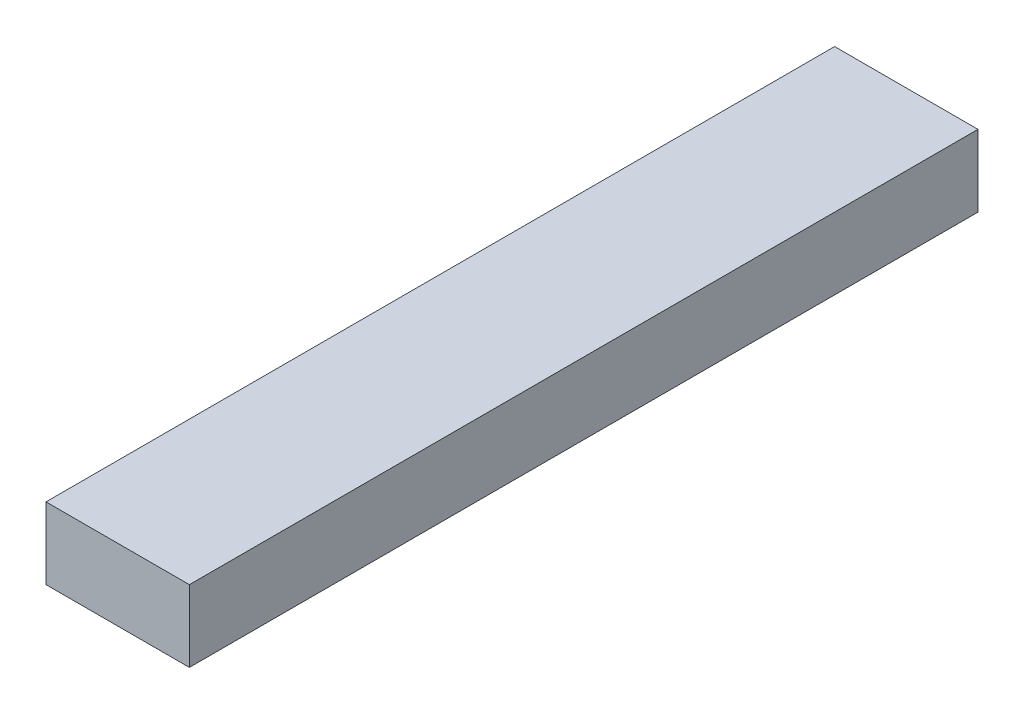
ISO-10303-21;
HEADER;
FILE_DESCRIPTION(('STEP AP214'),'2;1');
FILE_NAME('part.step','',(''),(''),'','','');
FILE_SCHEMA(('AUTOMOTIVE_DESIGN { 1 0 10303 214 1 1 1 1 }'));
ENDSEC;
DATA;
#1=APPLICATION_CONTEXT('core data for automotive mechanical design processes');
#2=APPLICATION_PROTOCOL_DEFINITION('international standard','automotive_design',2000,#1);
#3=PRODUCT_CONTEXT('',#1,'mechanical');
#4=PRODUCT('Part','Part','',(#3));
#5=PRODUCT_RELATED_PRODUCT_CATEGORY('part','',(#4));
#6=PRODUCT_DEFINITION_FORMATION('','',#4);
#7=PRODUCT_DEFINITION_CONTEXT('part definition',#1,'design');
#8=PRODUCT_DEFINITION('design','',#6,#7);
#9=PRODUCT_DEFINITION_SHAPE('','',#8);
#10=(LENGTH_UNIT() NAMED_UNIT(*) SI_UNIT(.MILLI.,.METRE.));
#11=(NAMED_UNIT(*) PLANE_ANGLE_UNIT() SI_UNIT($,.RADIAN.));
#12=(NAMED_UNIT(*) SI_UNIT($,.STERADIAN.) SOLID_ANGLE_UNIT());
#13=UNCERTAINTY_MEASURE_WITH_UNIT(LENGTH_MEASURE(1.E-05),#10,'distance_accuracy_value','');
#14=(GEOMETRIC_REPRESENTATION_CONTEXT(3) GLOBAL_UNCERTAINTY_ASSIGNED_CONTEXT((#13)) GLOBAL_UNIT_ASSIGNED_CONTEXT((#10,
#11,#12)) REPRESENTATION_CONTEXT('',''));
#15=CARTESIAN_POINT('',(0.,0.,0.));
#16=DIRECTION('',(0.,0.,1.));
#17=DIRECTION('',(1.,0.,0.));
#18=AXIS2_PLACEMENT_3D('',#15,#16,#17);
#19=CARTESIAN_POINT('',(-10.,10.,-55.));
#20=DIRECTION('',(1.,0.,0.));
#21=DIRECTION('',(0.,0.,-1.));
#22=AXIS2_PLACEMENT_3D('',#19,#20,#21);
#23=PLANE('',#22);
#24=DIRECTION('',(0.,0.,1.));
#25=VECTOR('',#24,1.);
#26=CARTESIAN_POINT('',(-10.,0.,-55.));
#27=LINE('',#26,#25);
#28=CARTESIAN_POINT('',(-10.,0.,-55.));
#29=VERTEX_POINT('',#28);
#30=CARTESIAN_POINT('',(-9.99999999999999,0.,55.));
#31=VERTEX_POINT('',#30);
#32=EDGE_CURVE('E96',#29,#31,#27,.T.);
#33=ORIENTED_EDGE('',*,*,#32,.T.);
#34=DIRECTION('',(0.,-1.,0.));
#35=VECTOR('',#34,1.);
#36=CARTESIAN_POINT('',(-9.99999999999999,10.,55.));
#37=LINE('',#36,#35);
#38=CARTESIAN_POINT('',(-9.99999999999999,10.,55.));
#39=VERTEX_POINT('',#38);
#40=EDGE_CURVE('E11',#39,#31,#37,.T.);
#41=ORIENTED_EDGE('',*,*,#40,.F.);
#42=DIRECTION('',(0.,0.,1.));
#43=VECTOR('',#42,1.);
#44=CARTESIAN_POINT('',(-10.,10.,-55.));
#45=LINE('',#44,#43);
#46=CARTESIAN_POINT('',(-10.,10.,-55.));
#47=VERTEX_POINT('',#46);
#48=EDGE_CURVE('E84',#47,#39,#45,.T.);
#49=ORIENTED_EDGE('',*,*,#48,.F.);
#50=DIRECTION('',(0.,-1.,0.));
#51=VECTOR('',#50,1.);
#52=CARTESIAN_POINT('',(-10.,10.,-55.));
#53=LINE('',#52,#51);
#54=EDGE_CURVE('E92',#47,#29,#53,.T.);
#55=ORIENTED_EDGE('',*,*,#54,.T.);
#56=EDGE_LOOP('',(#33,#41,#49,#55));
#57=FACE_BOUND('',#56,.T.);
#58=ADVANCED_FACE('F33',(#57),#23,.F.);
#59=CARTESIAN_POINT('',(-9.99999999999999,10.,55.));
#60=DIRECTION('',(0.,0.,-1.));
#61=DIRECTION('',(-1.,0.,0.));
#62=AXIS2_PLACEMENT_3D('',#59,#60,#61);
#63=PLANE('',#62);
#64=DIRECTION('',(1.,0.,0.));
#65=VECTOR('',#64,1.);
#66=CARTESIAN_POINT('',(-9.99999999999999,0.,55.));
#67=LINE('',#66,#65);
#68=CARTESIAN_POINT('',(10.,0.,55.));
#69=VERTEX_POINT('',#68);
#70=EDGE_CURVE('E88',#31,#69,#67,.T.);
#71=ORIENTED_EDGE('',*,*,#70,.T.);
#72=DIRECTION('',(0.,-1.,0.));
#73=VECTOR('',#72,1.);
#74=CARTESIAN_POINT('',(10.,10.,55.));
#75=LINE('',#74,#73);
#76=CARTESIAN_POINT('',(10.,10.,55.));
#77=VERTEX_POINT('',#76);
#78=EDGE_CURVE('E41',#77,#69,#75,.T.);
#79=ORIENTED_EDGE('',*,*,#78,.F.);
#80=DIRECTION('',(1.,0.,0.));
#81=VECTOR('',#80,1.);
#82=CARTESIAN_POINT('',(-9.99999999999999,10.,55.));
#83=LINE('',#82,#81);
#84=EDGE_CURVE('E79',#39,#77,#83,.T.);
#85=ORIENTED_EDGE('',*,*,#84,.F.);
#86=ORIENTED_EDGE('',*,*,#40,.T.);
#87=EDGE_LOOP('',(#71,#79,#85,#86));
#88=FACE_BOUND('',#87,.T.);
#89=ADVANCED_FACE('F87',(#88),#63,.F.);
#90=CARTESIAN_POINT('',(10.,10.,-55.));
#91=DIRECTION('',(-1.,0.,0.));
#92=DIRECTION('',(0.,0.,1.));
#93=AXIS2_PLACEMENT_3D('',#90,#91,#92);
#94=PLANE('',#93);
#95=DIRECTION('',(0.,0.,-1.));
#96=VECTOR('',#95,1.);
#97=CARTESIAN_POINT('',(10.,0.,-55.));
#98=LINE('',#97,#96);
#99=CARTESIAN_POINT('',(10.,0.,-55.));
#100=VERTEX_POINT('',#99);
#101=EDGE_CURVE('E66',#69,#100,#98,.T.);
#102=ORIENTED_EDGE('',*,*,#101,.T.);
#103=DIRECTION('',(0.,-1.,0.));
#104=VECTOR('',#103,1.);
#105=CARTESIAN_POINT('',(10.,10.,-55.));
#106=LINE('',#105,#104);
#107=CARTESIAN_POINT('',(10.,10.,-55.));
#108=VERTEX_POINT('',#107);
#109=EDGE_CURVE('E89',#108,#100,#106,.T.);
#110=ORIENTED_EDGE('',*,*,#109,.F.);
#111=DIRECTION('',(0.,0.,-1.));
#112=VECTOR('',#111,1.);
#113=CARTESIAN_POINT('',(10.,10.,-55.));
#114=LINE('',#113,#112);
#115=EDGE_CURVE('E82',#77,#108,#114,.T.);
#116=ORIENTED_EDGE('',*,*,#115,.F.);
#117=ORIENTED_EDGE('',*,*,#78,.T.);
#118=EDGE_LOOP('',(#102,#110,#116,#117));
#119=FACE_BOUND('',#118,.T.);
#120=ADVANCED_FACE('F90',(#119),#94,.F.);
#121=CARTESIAN_POINT('',(-10.,10.,-55.));
#122=DIRECTION('',(0.,0.,1.));
#123=DIRECTION('',(1.,0.,0.));
#124=AXIS2_PLACEMENT_3D('',#121,#122,#123);
#125=PLANE('',#124);
#126=DIRECTION('',(-1.,0.,0.));
#127=VECTOR('',#126,1.);
#128=CARTESIAN_POINT('',(-10.,0.,-55.));
#129=LINE('',#128,#127);
#130=EDGE_CURVE('E72',#100,#29,#129,.T.);
#131=ORIENTED_EDGE('',*,*,#130,.T.);
#132=ORIENTED_EDGE('',*,*,#54,.F.);
#133=DIRECTION('',(-1.,0.,0.));
#134=VECTOR('',#133,1.);
#135=CARTESIAN_POINT('',(-10.,10.,-55.));
#136=LINE('',#135,#134);
#137=EDGE_CURVE('E49',#108,#47,#136,.T.);
#138=ORIENTED_EDGE('',*,*,#137,.F.);
#139=ORIENTED_EDGE('',*,*,#109,.T.);
#140=EDGE_LOOP('',(#131,#132,#138,#139));
#141=FACE_BOUND('',#140,.T.);
#142=ADVANCED_FACE('F103',(#141),#125,.F.);
#143=CARTESIAN_POINT('',(0.,10.,0.));
#144=DIRECTION('',(0.,1.,0.));
#145=DIRECTION('',(0.,0.,1.));
#146=AXIS2_PLACEMENT_3D('',#143,#144,#145);
#147=PLANE('',#146);
#148=ORIENTED_EDGE('',*,*,#48,.T.);
#149=ORIENTED_EDGE('',*,*,#84,.T.);
#150=ORIENTED_EDGE('',*,*,#115,.T.);
#151=ORIENTED_EDGE('',*,*,#137,.T.);
#152=EDGE_LOOP('',(#148,#149,#150,#151));
#153=FACE_BOUND('',#152,.T.);
#154=ADVANCED_FACE('F80',(#153),#147,.T.);
#155=CARTESIAN_POINT('',(0.,0.,0.));
#156=DIRECTION('',(0.,1.,0.));
#157=DIRECTION('',(0.,0.,1.));
#158=AXIS2_PLACEMENT_3D('',#155,#156,#157);
#159=PLANE('',#158);
#160=ORIENTED_EDGE('',*,*,#32,.F.);
#161=ORIENTED_EDGE('',*,*,#130,.F.);
#162=ORIENTED_EDGE('',*,*,#101,.F.);
#163=ORIENTED_EDGE('',*,*,#70,.F.);
#164=EDGE_LOOP('',(#160,#161,#162,#163));
#165=FACE_BOUND('',#164,.T.);
#166=ADVANCED_FACE('F106',(#165),#159,.F.);
#167=CLOSED_SHELL('',(#58,#89,#120,#142,#154,#166));
#168=MANIFOLD_SOLID_BREP('B2',#167);
#169=ADVANCED_BREP_SHAPE_REPRESENTATION('',(#18,#168),#14);
#170=SHAPE_DEFINITION_REPRESENTATION(#9,#169);
ENDSEC;
END-ISO-10303-21;
